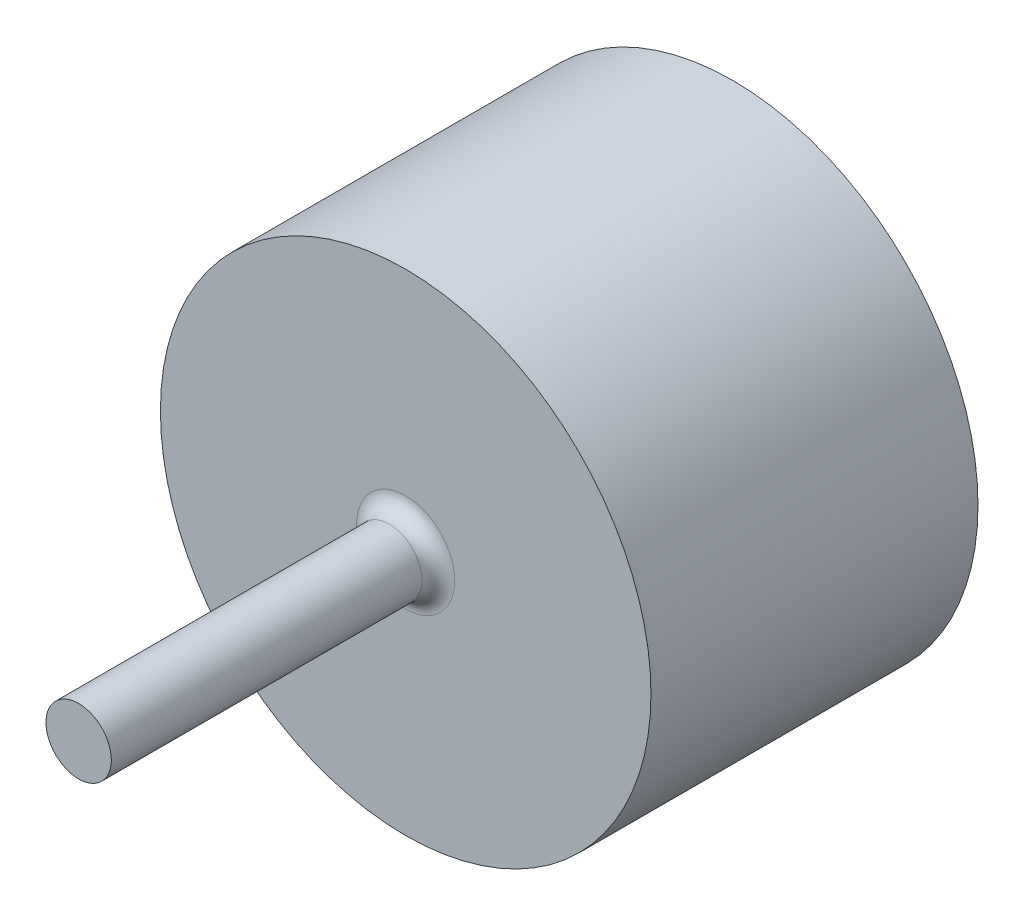
ISO-10303-21;
HEADER;
FILE_DESCRIPTION(('STEP AP214'),'2;1');
FILE_NAME('part.step','',(''),(''),'','','');
FILE_SCHEMA(('AUTOMOTIVE_DESIGN { 1 0 10303 214 1 1 1 1 }'));
ENDSEC;
DATA;
#1=APPLICATION_CONTEXT('core data for automotive mechanical design processes');
#2=APPLICATION_PROTOCOL_DEFINITION('international standard','automotive_design',2000,#1);
#3=PRODUCT_CONTEXT('',#1,'mechanical');
#4=PRODUCT('Part','Part','',(#3));
#5=PRODUCT_RELATED_PRODUCT_CATEGORY('part','',(#4));
#6=PRODUCT_DEFINITION_FORMATION('','',#4);
#7=PRODUCT_DEFINITION_CONTEXT('part definition',#1,'design');
#8=PRODUCT_DEFINITION('design','',#6,#7);
#9=PRODUCT_DEFINITION_SHAPE('','',#8);
#10=(LENGTH_UNIT() NAMED_UNIT(*) SI_UNIT(.MILLI.,.METRE.));
#11=(NAMED_UNIT(*) PLANE_ANGLE_UNIT() SI_UNIT($,.RADIAN.));
#12=(NAMED_UNIT(*) SI_UNIT($,.STERADIAN.) SOLID_ANGLE_UNIT());
#13=UNCERTAINTY_MEASURE_WITH_UNIT(LENGTH_MEASURE(1.E-05),#10,'distance_accuracy_value','');
#14=(GEOMETRIC_REPRESENTATION_CONTEXT(3) GLOBAL_UNCERTAINTY_ASSIGNED_CONTEXT((#13)) GLOBAL_UNIT_ASSIGNED_CONTEXT((#10,
#11,#12)) REPRESENTATION_CONTEXT('',''));
#15=CARTESIAN_POINT('',(0.,0.,0.));
#16=DIRECTION('',(0.,0.,1.));
#17=DIRECTION('',(1.,0.,0.));
#18=AXIS2_PLACEMENT_3D('',#15,#16,#17);
#19=CARTESIAN_POINT('',(0.,0.,100.));
#20=DIRECTION('',(0.,0.,-1.));
#21=DIRECTION('',(-1.,0.,0.));
#22=AXIS2_PLACEMENT_3D('',#19,#20,#21);
#23=CYLINDRICAL_SURFACE('',#22,75.);
#24=CARTESIAN_POINT('',(0.,0.,100.));
#25=DIRECTION('',(0.,0.,1.));
#26=DIRECTION('',(1.,0.,0.));
#27=AXIS2_PLACEMENT_3D('',#24,#25,#26);
#28=CIRCLE('',#27,75.);
#29=CARTESIAN_POINT('',(75.,0.,100.));
#30=VERTEX_POINT('',#29);
#31=EDGE_CURVE('E44',#30,#30,#28,.T.);
#32=ORIENTED_EDGE('',*,*,#31,.F.);
#33=EDGE_LOOP('',(#32));
#34=FACE_BOUND('',#33,.T.);
#35=CARTESIAN_POINT('',(0.,0.,0.));
#36=DIRECTION('',(0.,0.,1.));
#37=DIRECTION('',(1.,0.,0.));
#38=AXIS2_PLACEMENT_3D('',#35,#36,#37);
#39=CIRCLE('',#38,75.);
#40=CARTESIAN_POINT('',(75.,0.,0.));
#41=VERTEX_POINT('',#40);
#42=EDGE_CURVE('E48',#41,#41,#39,.T.);
#43=ORIENTED_EDGE('',*,*,#42,.T.);
#44=EDGE_LOOP('',(#43));
#45=FACE_BOUND('',#44,.T.);
#46=ADVANCED_FACE('F33',(#34,#45),#23,.T.);
#47=CARTESIAN_POINT('',(0.,0.,100.));
#48=DIRECTION('',(0.,0.,1.));
#49=DIRECTION('',(1.,0.,0.));
#50=AXIS2_PLACEMENT_3D('',#47,#48,#49);
#51=PLANE('',#50);
#52=CARTESIAN_POINT('',(0.,0.,100.));
#53=DIRECTION('',(0.,0.,1.));
#54=DIRECTION('',(1.,0.,0.));
#55=AXIS2_PLACEMENT_3D('',#52,#53,#54);
#56=CIRCLE('',#55,15.);
#57=CARTESIAN_POINT('',(15.,0.,100.));
#58=VERTEX_POINT('',#57);
#59=EDGE_CURVE('E10',#58,#58,#56,.F.);
#60=ORIENTED_EDGE('',*,*,#59,.T.);
#61=EDGE_LOOP('',(#60));
#62=FACE_BOUND('',#61,.T.);
#63=ORIENTED_EDGE('',*,*,#31,.T.);
#64=EDGE_LOOP('',(#63));
#65=FACE_BOUND('',#64,.T.);
#66=ADVANCED_FACE('F68',(#62,#65),#51,.T.);
#67=CARTESIAN_POINT('',(0.,0.,0.));
#68=DIRECTION('',(0.,0.,1.));
#69=DIRECTION('',(1.,0.,0.));
#70=AXIS2_PLACEMENT_3D('',#67,#68,#69);
#71=PLANE('',#70);
#72=ORIENTED_EDGE('',*,*,#42,.F.);
#73=EDGE_LOOP('',(#72));
#74=FACE_BOUND('',#73,.T.);
#75=ADVANCED_FACE('F61',(#74),#71,.F.);
#76=CARTESIAN_POINT('',(0.,0.,200.));
#77=DIRECTION('',(0.,0.,-1.));
#78=DIRECTION('',(-1.,0.,0.));
#79=AXIS2_PLACEMENT_3D('',#76,#77,#78);
#80=CYLINDRICAL_SURFACE('',#79,10.);
#81=CARTESIAN_POINT('',(0.,0.,105.));
#82=DIRECTION('',(0.,0.,1.));
#83=DIRECTION('',(1.,0.,0.));
#84=AXIS2_PLACEMENT_3D('',#81,#82,#83);
#85=CIRCLE('',#84,10.);
#86=CARTESIAN_POINT('',(10.,0.,105.));
#87=VERTEX_POINT('',#86);
#88=EDGE_CURVE('E40',#87,#87,#85,.T.);
#89=ORIENTED_EDGE('',*,*,#88,.T.);
#90=EDGE_LOOP('',(#89));
#91=FACE_BOUND('',#90,.T.);
#92=CARTESIAN_POINT('',(0.,0.,200.));
#93=DIRECTION('',(0.,0.,1.));
#94=DIRECTION('',(1.,0.,0.));
#95=AXIS2_PLACEMENT_3D('',#92,#93,#94);
#96=CIRCLE('',#95,10.);
#97=CARTESIAN_POINT('',(10.,0.,200.));
#98=VERTEX_POINT('',#97);
#99=EDGE_CURVE('E52',#98,#98,#96,.T.);
#100=ORIENTED_EDGE('',*,*,#99,.F.);
#101=EDGE_LOOP('',(#100));
#102=FACE_BOUND('',#101,.T.);
#103=ADVANCED_FACE('F59',(#91,#102),#80,.T.);
#104=CARTESIAN_POINT('',(0.,0.,200.));
#105=DIRECTION('',(0.,0.,1.));
#106=DIRECTION('',(1.,0.,0.));
#107=AXIS2_PLACEMENT_3D('',#104,#105,#106);
#108=PLANE('',#107);
#109=ORIENTED_EDGE('',*,*,#99,.T.);
#110=EDGE_LOOP('',(#109));
#111=FACE_BOUND('',#110,.T.);
#112=ADVANCED_FACE('F57',(#111),#108,.T.);
#113=CARTESIAN_POINT('',(0.,0.,105.));
#114=DIRECTION('',(0.,0.,1.));
#115=DIRECTION('',(1.,0.,0.));
#116=AXIS2_PLACEMENT_3D('',#113,#114,#115);
#117=TOROIDAL_SURFACE('',#116,15.,5.);
#118=ORIENTED_EDGE('',*,*,#59,.F.);
#119=EDGE_LOOP('',(#118));
#120=FACE_BOUND('',#119,.T.);
#121=ORIENTED_EDGE('',*,*,#88,.F.);
#122=EDGE_LOOP('',(#121));
#123=FACE_BOUND('',#122,.T.);
#124=ADVANCED_FACE('F35',(#120,#123),#117,.F.);
#125=CLOSED_SHELL('',(#46,#66,#75,#103,#112,#124));
#126=MANIFOLD_SOLID_BREP('B2',#125);
#127=ADVANCED_BREP_SHAPE_REPRESENTATION('',(#18,#126),#14);
#128=SHAPE_DEFINITION_REPRESENTATION(#9,#127);
ENDSEC;
END-ISO-10303-21;
